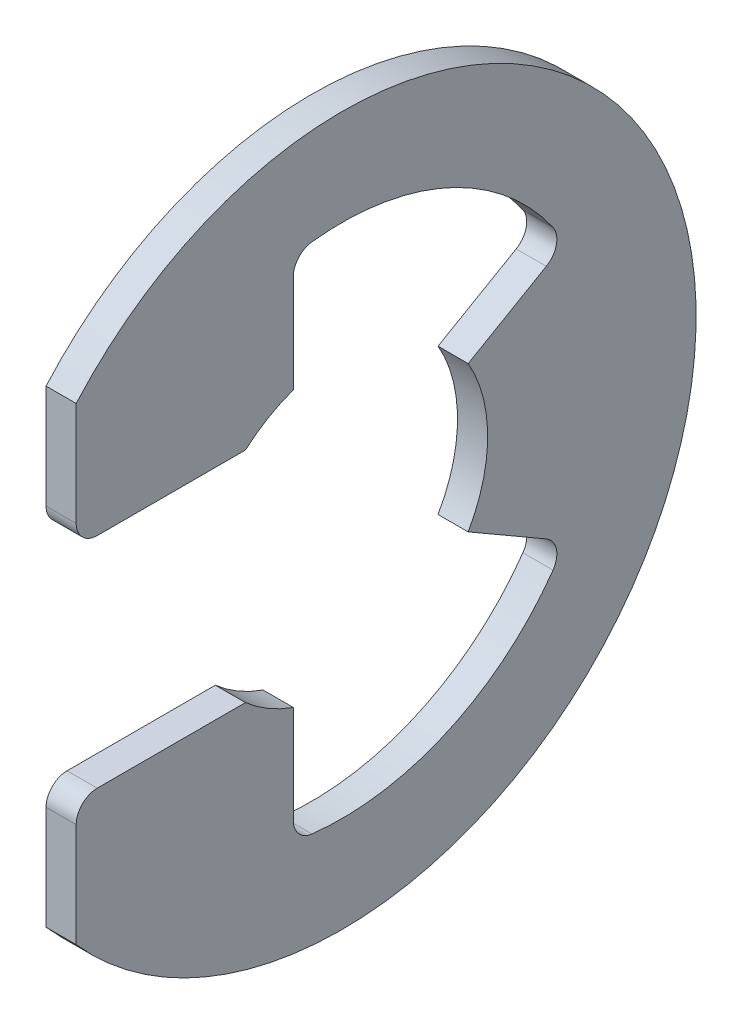
ISO-10303-21;
HEADER;
FILE_DESCRIPTION(('STEP AP214'),'2;1');
FILE_NAME('part.step','',(''),(''),'','','');
FILE_SCHEMA(('AUTOMOTIVE_DESIGN { 1 0 10303 214 1 1 1 1 }'));
ENDSEC;
DATA;
#1=APPLICATION_CONTEXT('core data for automotive mechanical design processes');
#2=APPLICATION_PROTOCOL_DEFINITION('international standard','automotive_design',2000,#1);
#3=PRODUCT_CONTEXT('',#1,'mechanical');
#4=PRODUCT('Part','Part','',(#3));
#5=PRODUCT_RELATED_PRODUCT_CATEGORY('part','',(#4));
#6=PRODUCT_DEFINITION_FORMATION('','',#4);
#7=PRODUCT_DEFINITION_CONTEXT('part definition',#1,'design');
#8=PRODUCT_DEFINITION('design','',#6,#7);
#9=PRODUCT_DEFINITION_SHAPE('','',#8);
#10=(LENGTH_UNIT() NAMED_UNIT(*) SI_UNIT(.MILLI.,.METRE.));
#11=(NAMED_UNIT(*) PLANE_ANGLE_UNIT() SI_UNIT($,.RADIAN.));
#12=(NAMED_UNIT(*) SI_UNIT($,.STERADIAN.) SOLID_ANGLE_UNIT());
#13=UNCERTAINTY_MEASURE_WITH_UNIT(LENGTH_MEASURE(1.E-05),#10,'distance_accuracy_value','');
#14=(GEOMETRIC_REPRESENTATION_CONTEXT(3) GLOBAL_UNCERTAINTY_ASSIGNED_CONTEXT((#13)) GLOBAL_UNIT_ASSIGNED_CONTEXT((#10,
#11,#12)) REPRESENTATION_CONTEXT('',''));
#15=CARTESIAN_POINT('',(0.,0.,0.));
#16=DIRECTION('',(0.,0.,1.));
#17=DIRECTION('',(1.,0.,0.));
#18=AXIS2_PLACEMENT_3D('',#15,#16,#17);
#19=CARTESIAN_POINT('',(0.3175,0.,0.));
#20=DIRECTION('',(-1.,0.,0.));
#21=DIRECTION('',(0.,0.,1.));
#22=AXIS2_PLACEMENT_3D('',#19,#20,#21);
#23=CYLINDRICAL_SURFACE('',#22,7.4676);
#24=CARTESIAN_POINT('',(-0.3175,0.,0.));
#25=DIRECTION('',(1.,0.,0.));
#26=DIRECTION('',(0.,0.,-1.));
#27=AXIS2_PLACEMENT_3D('',#24,#25,#26);
#28=CIRCLE('',#27,7.4676);
#29=CARTESIAN_POINT('',(-0.3175,-4.93935312262648,5.6007));
#30=VERTEX_POINT('',#29);
#31=CARTESIAN_POINT('',(-0.3175,4.93935312262648,5.6007));
#32=VERTEX_POINT('',#31);
#33=EDGE_CURVE('E194',#30,#32,#28,.T.);
#34=ORIENTED_EDGE('',*,*,#33,.T.);
#35=DIRECTION('',(-1.,0.,0.));
#36=VECTOR('',#35,1.);
#37=CARTESIAN_POINT('',(0.3175,4.93935312262648,5.6007));
#38=LINE('',#37,#36);
#39=CARTESIAN_POINT('',(0.3175,4.93935312262648,5.6007));
#40=VERTEX_POINT('',#39);
#41=EDGE_CURVE('E175',#40,#32,#38,.T.);
#42=ORIENTED_EDGE('',*,*,#41,.F.);
#43=CARTESIAN_POINT('',(0.3175,0.,0.));
#44=DIRECTION('',(1.,0.,0.));
#45=DIRECTION('',(0.,0.,-1.));
#46=AXIS2_PLACEMENT_3D('',#43,#44,#45);
#47=CIRCLE('',#46,7.4676);
#48=CARTESIAN_POINT('',(0.3175,-4.93935312262648,5.6007));
#49=VERTEX_POINT('',#48);
#50=EDGE_CURVE('E181',#49,#40,#47,.T.);
#51=ORIENTED_EDGE('',*,*,#50,.F.);
#52=DIRECTION('',(-1.,0.,0.));
#53=VECTOR('',#52,1.);
#54=CARTESIAN_POINT('',(0.3175,-4.93935312262648,5.6007));
#55=LINE('',#54,#53);
#56=EDGE_CURVE('E296',#49,#30,#55,.T.);
#57=ORIENTED_EDGE('',*,*,#56,.T.);
#58=EDGE_LOOP('',(#34,#42,#51,#57));
#59=FACE_BOUND('',#58,.T.);
#60=ADVANCED_FACE('F32',(#59),#23,.T.);
#61=CARTESIAN_POINT('',(0.3175,4.93935312262648,5.6007));
#62=DIRECTION('',(0.,0.,-1.));
#63=DIRECTION('',(-1.,0.,0.));
#64=AXIS2_PLACEMENT_3D('',#61,#62,#63);
#65=PLANE('',#64);
#66=DIRECTION('',(0.,-1.,0.));
#67=VECTOR('',#66,1.);
#68=CARTESIAN_POINT('',(-0.3175,4.93935312262648,5.6007));
#69=LINE('',#68,#67);
#70=CARTESIAN_POINT('',(-0.3175,2.74955,5.6007));
#71=VERTEX_POINT('',#70);
#72=EDGE_CURVE('E298',#32,#71,#69,.T.);
#73=ORIENTED_EDGE('',*,*,#72,.T.);
#74=DIRECTION('',(-1.,0.,0.));
#75=VECTOR('',#74,1.);
#76=CARTESIAN_POINT('',(0.3175,2.74955,5.6007));
#77=LINE('',#76,#75);
#78=CARTESIAN_POINT('',(0.3175,2.74955,5.6007));
#79=VERTEX_POINT('',#78);
#80=EDGE_CURVE('E178',#71,#79,#77,.F.);
#81=ORIENTED_EDGE('',*,*,#80,.T.);
#82=DIRECTION('',(0.,-1.,0.));
#83=VECTOR('',#82,1.);
#84=CARTESIAN_POINT('',(0.3175,4.93935312262648,5.6007));
#85=LINE('',#84,#83);
#86=EDGE_CURVE('E170',#40,#79,#85,.T.);
#87=ORIENTED_EDGE('',*,*,#86,.F.);
#88=ORIENTED_EDGE('',*,*,#41,.T.);
#89=EDGE_LOOP('',(#73,#81,#87,#88));
#90=FACE_BOUND('',#89,.T.);
#91=ADVANCED_FACE('F173',(#90),#65,.F.);
#92=CARTESIAN_POINT('',(0.3175,2.30505,2.03286301985648));
#93=DIRECTION('',(0.,1.,0.));
#94=DIRECTION('',(0.,0.,1.));
#95=AXIS2_PLACEMENT_3D('',#92,#93,#94);
#96=PLANE('',#95);
#97=DIRECTION('',(0.,0.,-1.));
#98=VECTOR('',#97,1.);
#99=CARTESIAN_POINT('',(0.3175,2.30505,2.03286301985648));
#100=LINE('',#99,#98);
#101=CARTESIAN_POINT('',(0.3175,2.30505,5.1562));
#102=VERTEX_POINT('',#101);
#103=CARTESIAN_POINT('',(0.3175,2.30505,2.03286301985648));
#104=VERTEX_POINT('',#103);
#105=EDGE_CURVE('E180',#102,#104,#100,.T.);
#106=ORIENTED_EDGE('',*,*,#105,.F.);
#107=DIRECTION('',(-1.,0.,0.));
#108=VECTOR('',#107,1.);
#109=CARTESIAN_POINT('',(0.3175,2.30505,5.1562));
#110=LINE('',#109,#108);
#111=CARTESIAN_POINT('',(-0.3175,2.30505,5.1562));
#112=VERTEX_POINT('',#111);
#113=EDGE_CURVE('E222',#102,#112,#110,.T.);
#114=ORIENTED_EDGE('',*,*,#113,.T.);
#115=DIRECTION('',(0.,0.,-1.));
#116=VECTOR('',#115,1.);
#117=CARTESIAN_POINT('',(-0.3175,2.30505,2.03286301985648));
#118=LINE('',#117,#116);
#119=CARTESIAN_POINT('',(-0.3175,2.30505,2.03286301985648));
#120=VERTEX_POINT('',#119);
#121=EDGE_CURVE('E300',#112,#120,#118,.T.);
#122=ORIENTED_EDGE('',*,*,#121,.T.);
#123=DIRECTION('',(-1.,0.,0.));
#124=VECTOR('',#123,1.);
#125=CARTESIAN_POINT('',(0.3175,2.30505,2.03286301985648));
#126=LINE('',#125,#124);
#127=EDGE_CURVE('E196',#104,#120,#126,.T.);
#128=ORIENTED_EDGE('',*,*,#127,.F.);
#129=EDGE_LOOP('',(#106,#114,#122,#128));
#130=FACE_BOUND('',#129,.T.);
#131=ADVANCED_FACE('F354',(#130),#96,.F.);
#132=CARTESIAN_POINT('',(0.3175,0.,0.));
#133=DIRECTION('',(-1.,0.,0.));
#134=DIRECTION('',(0.,0.,1.));
#135=AXIS2_PLACEMENT_3D('',#132,#133,#134);
#136=CYLINDRICAL_SURFACE('',#135,3.0734);
#137=CARTESIAN_POINT('',(-0.3175,0.,0.));
#138=DIRECTION('',(-1.,0.,0.));
#139=DIRECTION('',(0.,0.,1.));
#140=AXIS2_PLACEMENT_3D('',#137,#138,#139);
#141=CIRCLE('',#140,3.0734);
#142=CARTESIAN_POINT('',(-0.3175,2.89762930839831,1.02446666666667));
#143=VERTEX_POINT('',#142);
#144=EDGE_CURVE('E302',#120,#143,#141,.T.);
#145=ORIENTED_EDGE('',*,*,#144,.T.);
#146=DIRECTION('',(-1.,0.,0.));
#147=VECTOR('',#146,1.);
#148=CARTESIAN_POINT('',(0.3175,2.89762930839831,1.02446666666667));
#149=LINE('',#148,#147);
#150=CARTESIAN_POINT('',(0.3175,2.89762930839831,1.02446666666667));
#151=VERTEX_POINT('',#150);
#152=EDGE_CURVE('E202',#151,#143,#149,.T.);
#153=ORIENTED_EDGE('',*,*,#152,.F.);
#154=CARTESIAN_POINT('',(0.3175,0.,0.));
#155=DIRECTION('',(-1.,0.,0.));
#156=DIRECTION('',(0.,0.,1.));
#157=AXIS2_PLACEMENT_3D('',#154,#155,#156);
#158=CIRCLE('',#157,3.0734);
#159=EDGE_CURVE('E347',#104,#151,#158,.T.);
#160=ORIENTED_EDGE('',*,*,#159,.F.);
#161=ORIENTED_EDGE('',*,*,#127,.T.);
#162=EDGE_LOOP('',(#145,#153,#160,#161));
#163=FACE_BOUND('',#162,.T.);
#164=ADVANCED_FACE('F355',(#163),#136,.F.);
#165=CARTESIAN_POINT('',(0.3175,5.3431904138959,1.02446666666667));
#166=DIRECTION('',(0.,0.,1.));
#167=DIRECTION('',(0.,-1.,0.));
#168=AXIS2_PLACEMENT_3D('',#165,#166,#167);
#169=PLANE('',#168);
#170=DIRECTION('',(0.,1.,0.));
#171=VECTOR('',#170,1.);
#172=CARTESIAN_POINT('',(-0.3175,5.3431904138959,1.02446666666667));
#173=LINE('',#172,#171);
#174=CARTESIAN_POINT('',(-0.3175,4.96223899334827,1.02446666666667));
#175=VERTEX_POINT('',#174);
#176=EDGE_CURVE('E265',#143,#175,#173,.T.);
#177=ORIENTED_EDGE('',*,*,#176,.T.);
#178=DIRECTION('',(1.,0.,0.));
#179=VECTOR('',#178,1.);
#180=CARTESIAN_POINT('',(0.3175,4.96223899334827,1.02446666666667));
#181=LINE('',#180,#179);
#182=CARTESIAN_POINT('',(0.3175,4.96223899334827,1.02446666666667));
#183=VERTEX_POINT('',#182);
#184=EDGE_CURVE('E231',#175,#183,#181,.T.);
#185=ORIENTED_EDGE('',*,*,#184,.T.);
#186=DIRECTION('',(0.,1.,0.));
#187=VECTOR('',#186,1.);
#188=CARTESIAN_POINT('',(0.3175,5.3431904138959,1.02446666666667));
#189=LINE('',#188,#187);
#190=EDGE_CURVE('E281',#151,#183,#189,.T.);
#191=ORIENTED_EDGE('',*,*,#190,.F.);
#192=ORIENTED_EDGE('',*,*,#152,.T.);
#193=EDGE_LOOP('',(#177,#185,#191,#192));
#194=FACE_BOUND('',#193,.T.);
#195=ADVANCED_FACE('F337',(#194),#169,.F.);
#196=CARTESIAN_POINT('',(0.3175,0.,0.));
#197=DIRECTION('',(-1.,0.,0.));
#198=DIRECTION('',(0.,0.,1.));
#199=AXIS2_PLACEMENT_3D('',#196,#197,#198);
#200=CYLINDRICAL_SURFACE('',#199,5.44051612903226);
#201=CARTESIAN_POINT('',(0.3175,0.,0.));
#202=DIRECTION('',(-1.,0.,0.));
#203=DIRECTION('',(0.,0.,-1.));
#204=AXIS2_PLACEMENT_3D('',#201,#202,#203);
#205=CIRCLE('',#204,5.44051612903226);
#206=CARTESIAN_POINT('',(0.3175,5.40373381153464,0.631566817001502));
#207=VERTEX_POINT('',#206);
#208=CARTESIAN_POINT('',(0.3175,3.12866762176277,-4.45091615993757));
#209=VERTEX_POINT('',#208);
#210=EDGE_CURVE('E271',#207,#209,#205,.T.);
#211=ORIENTED_EDGE('',*,*,#210,.F.);
#212=DIRECTION('',(-1.,0.,0.));
#213=VECTOR('',#212,1.);
#214=CARTESIAN_POINT('',(0.3175,5.40373381153464,0.631566817001502));
#215=LINE('',#214,#213);
#216=CARTESIAN_POINT('',(-0.3175,5.40373381153464,0.631566817001502));
#217=VERTEX_POINT('',#216);
#218=EDGE_CURVE('E228',#207,#217,#215,.T.);
#219=ORIENTED_EDGE('',*,*,#218,.T.);
#220=CARTESIAN_POINT('',(-0.3175,0.,0.));
#221=DIRECTION('',(-1.,0.,0.));
#222=DIRECTION('',(0.,0.,-1.));
#223=AXIS2_PLACEMENT_3D('',#220,#221,#222);
#224=CIRCLE('',#223,5.44051612903226);
#225=CARTESIAN_POINT('',(-0.3175,3.12866762176277,-4.45091615993757));
#226=VERTEX_POINT('',#225);
#227=EDGE_CURVE('E254',#217,#226,#224,.T.);
#228=ORIENTED_EDGE('',*,*,#227,.T.);
#229=DIRECTION('',(-1.,0.,0.));
#230=VECTOR('',#229,1.);
#231=CARTESIAN_POINT('',(0.3175,3.12866762176277,-4.45091615993757));
#232=LINE('',#231,#230);
#233=EDGE_CURVE('E226',#226,#209,#232,.F.);
#234=ORIENTED_EDGE('',*,*,#233,.T.);
#235=EDGE_LOOP('',(#211,#219,#228,#234));
#236=FACE_BOUND('',#235,.T.);
#237=ADVANCED_FACE('F262',(#236),#200,.F.);
#238=CARTESIAN_POINT('',(0.3175,1.5367,-2.66164247599109));
#239=DIRECTION('',(0.,-0.866025403784438,-0.500000000000001));
#240=DIRECTION('',(0.,0.500000000000001,-0.866025403784438));
#241=AXIS2_PLACEMENT_3D('',#238,#239,#240);
#242=PLANE('',#241);
#243=DIRECTION('',(0.,-0.500000000000001,0.866025403784438));
#244=VECTOR('',#243,1.);
#245=CARTESIAN_POINT('',(0.3175,1.5367,-2.66164247599109));
#246=LINE('',#245,#244);
#247=CARTESIAN_POINT('',(0.3175,2.48810153086397,-4.30951826584629));
#248=VERTEX_POINT('',#247);
#249=CARTESIAN_POINT('',(0.3175,1.5367,-2.66164247599109));
#250=VERTEX_POINT('',#249);
#251=EDGE_CURVE('E269',#248,#250,#246,.T.);
#252=ORIENTED_EDGE('',*,*,#251,.F.);
#253=DIRECTION('',(1.,0.,0.));
#254=VECTOR('',#253,1.);
#255=CARTESIAN_POINT('',(-0.3175,2.48810153086397,-4.30951826584629));
#256=LINE('',#255,#254);
#257=CARTESIAN_POINT('',(-0.3175,2.48810153086397,-4.30951826584629));
#258=VERTEX_POINT('',#257);
#259=EDGE_CURVE('E235',#248,#258,#256,.F.);
#260=ORIENTED_EDGE('',*,*,#259,.T.);
#261=DIRECTION('',(0.,-0.500000000000001,0.866025403784438));
#262=VECTOR('',#261,1.);
#263=CARTESIAN_POINT('',(-0.3175,1.5367,-2.66164247599109));
#264=LINE('',#263,#262);
#265=CARTESIAN_POINT('',(-0.3175,1.5367,-2.66164247599109));
#266=VERTEX_POINT('',#265);
#267=EDGE_CURVE('E256',#258,#266,#264,.T.);
#268=ORIENTED_EDGE('',*,*,#267,.T.);
#269=DIRECTION('',(-1.,0.,0.));
#270=VECTOR('',#269,1.);
#271=CARTESIAN_POINT('',(0.3175,1.5367,-2.66164247599109));
#272=LINE('',#271,#270);
#273=EDGE_CURVE('E275',#250,#266,#272,.T.);
#274=ORIENTED_EDGE('',*,*,#273,.F.);
#275=EDGE_LOOP('',(#252,#260,#268,#274));
#276=FACE_BOUND('',#275,.T.);
#277=ADVANCED_FACE('F273',(#276),#242,.F.);
#278=CARTESIAN_POINT('',(0.3175,0.,0.));
#279=DIRECTION('',(-1.,0.,0.));
#280=DIRECTION('',(0.,0.,1.));
#281=AXIS2_PLACEMENT_3D('',#278,#279,#280);
#282=CYLINDRICAL_SURFACE('',#281,3.0734);
#283=CARTESIAN_POINT('',(-0.3175,0.,0.));
#284=DIRECTION('',(-1.,0.,0.));
#285=DIRECTION('',(0.,0.,1.));
#286=AXIS2_PLACEMENT_3D('',#283,#284,#285);
#287=CIRCLE('',#286,3.0734);
#288=CARTESIAN_POINT('',(-0.3175,-1.5367,-2.66164247599109));
#289=VERTEX_POINT('',#288);
#290=EDGE_CURVE('E307',#266,#289,#287,.T.);
#291=ORIENTED_EDGE('',*,*,#290,.T.);
#292=DIRECTION('',(-1.,0.,0.));
#293=VECTOR('',#292,1.);
#294=CARTESIAN_POINT('',(0.3175,-1.5367,-2.66164247599109));
#295=LINE('',#294,#293);
#296=CARTESIAN_POINT('',(0.3175,-1.5367,-2.66164247599109));
#297=VERTEX_POINT('',#296);
#298=EDGE_CURVE('E329',#297,#289,#295,.T.);
#299=ORIENTED_EDGE('',*,*,#298,.F.);
#300=CARTESIAN_POINT('',(0.3175,0.,0.));
#301=DIRECTION('',(-1.,0.,0.));
#302=DIRECTION('',(0.,0.,1.));
#303=AXIS2_PLACEMENT_3D('',#300,#301,#302);
#304=CIRCLE('',#303,3.0734);
#305=EDGE_CURVE('E277',#250,#297,#304,.T.);
#306=ORIENTED_EDGE('',*,*,#305,.F.);
#307=ORIENTED_EDGE('',*,*,#273,.T.);
#308=EDGE_LOOP('',(#291,#299,#306,#307));
#309=FACE_BOUND('',#308,.T.);
#310=ADVANCED_FACE('F435',(#309),#282,.F.);
#311=CARTESIAN_POINT('',(0.3175,-1.5367,-2.66164247599109));
#312=DIRECTION('',(0.,0.866025403784438,-0.500000000000001));
#313=DIRECTION('',(0.,0.500000000000001,0.866025403784438));
#314=AXIS2_PLACEMENT_3D('',#311,#312,#313);
#315=PLANE('',#314);
#316=DIRECTION('',(0.,-0.500000000000001,-0.866025403784438));
#317=VECTOR('',#316,1.);
#318=CARTESIAN_POINT('',(-0.3175,-1.5367,-2.66164247599109));
#319=LINE('',#318,#317);
#320=CARTESIAN_POINT('',(-0.3175,-2.48810153086397,-4.30951826584629));
#321=VERTEX_POINT('',#320);
#322=EDGE_CURVE('E309',#289,#321,#319,.T.);
#323=ORIENTED_EDGE('',*,*,#322,.T.);
#324=DIRECTION('',(1.,0.,0.));
#325=VECTOR('',#324,1.);
#326=CARTESIAN_POINT('',(0.3175,-2.48810153086397,-4.30951826584629));
#327=LINE('',#326,#325);
#328=CARTESIAN_POINT('',(0.3175,-2.48810153086397,-4.30951826584629));
#329=VERTEX_POINT('',#328);
#330=EDGE_CURVE('E233',#321,#329,#327,.T.);
#331=ORIENTED_EDGE('',*,*,#330,.T.);
#332=DIRECTION('',(0.,-0.500000000000001,-0.866025403784438));
#333=VECTOR('',#332,1.);
#334=CARTESIAN_POINT('',(0.3175,-1.5367,-2.66164247599109));
#335=LINE('',#334,#333);
#336=EDGE_CURVE('E279',#297,#329,#335,.T.);
#337=ORIENTED_EDGE('',*,*,#336,.F.);
#338=ORIENTED_EDGE('',*,*,#298,.T.);
#339=EDGE_LOOP('',(#323,#331,#337,#338));
#340=FACE_BOUND('',#339,.T.);
#341=ADVANCED_FACE('F432',(#340),#315,.F.);
#342=CARTESIAN_POINT('',(0.3175,0.,0.));
#343=DIRECTION('',(-1.,0.,0.));
#344=DIRECTION('',(0.,0.,1.));
#345=AXIS2_PLACEMENT_3D('',#342,#343,#344);
#346=CYLINDRICAL_SURFACE('',#345,5.44051612903226);
#347=CARTESIAN_POINT('',(-0.3175,0.,0.));
#348=DIRECTION('',(-1.,0.,0.));
#349=DIRECTION('',(0.,0.,-1.));
#350=AXIS2_PLACEMENT_3D('',#347,#348,#349);
#351=CIRCLE('',#350,5.44051612903226);
#352=CARTESIAN_POINT('',(-0.3175,-3.12866762176276,-4.45091615993758));
#353=VERTEX_POINT('',#352);
#354=CARTESIAN_POINT('',(-0.3175,-5.40373381153464,0.631566817001501));
#355=VERTEX_POINT('',#354);
#356=EDGE_CURVE('E312',#353,#355,#351,.T.);
#357=ORIENTED_EDGE('',*,*,#356,.T.);
#358=DIRECTION('',(-1.,0.,0.));
#359=VECTOR('',#358,1.);
#360=CARTESIAN_POINT('',(0.3175,-5.40373381153464,0.631566817001501));
#361=LINE('',#360,#359);
#362=CARTESIAN_POINT('',(0.3175,-5.40373381153464,0.631566817001501));
#363=VERTEX_POINT('',#362);
#364=EDGE_CURVE('E55',#355,#363,#361,.F.);
#365=ORIENTED_EDGE('',*,*,#364,.T.);
#366=CARTESIAN_POINT('',(0.3175,0.,0.));
#367=DIRECTION('',(-1.,0.,0.));
#368=DIRECTION('',(0.,0.,-1.));
#369=AXIS2_PLACEMENT_3D('',#366,#367,#368);
#370=CIRCLE('',#369,5.44051612903226);
#371=CARTESIAN_POINT('',(0.3175,-3.12866762176276,-4.45091615993758));
#372=VERTEX_POINT('',#371);
#373=EDGE_CURVE('E287',#372,#363,#370,.T.);
#374=ORIENTED_EDGE('',*,*,#373,.F.);
#375=DIRECTION('',(-1.,0.,0.));
#376=VECTOR('',#375,1.);
#377=CARTESIAN_POINT('',(0.3175,-3.12866762176276,-4.45091615993758));
#378=LINE('',#377,#376);
#379=EDGE_CURVE('E218',#372,#353,#378,.T.);
#380=ORIENTED_EDGE('',*,*,#379,.T.);
#381=EDGE_LOOP('',(#357,#365,#374,#380));
#382=FACE_BOUND('',#381,.T.);
#383=ADVANCED_FACE('F394',(#382),#346,.F.);
#384=CARTESIAN_POINT('',(0.3175,-2.89762930839831,1.02446666666666));
#385=DIRECTION('',(0.,0.,1.));
#386=DIRECTION('',(0.,-1.,0.));
#387=AXIS2_PLACEMENT_3D('',#384,#385,#386);
#388=PLANE('',#387);
#389=DIRECTION('',(0.,1.,0.));
#390=VECTOR('',#389,1.);
#391=CARTESIAN_POINT('',(0.3175,-2.89762930839831,1.02446666666666));
#392=LINE('',#391,#390);
#393=CARTESIAN_POINT('',(0.3175,-4.96223899334827,1.02446666666666));
#394=VERTEX_POINT('',#393);
#395=CARTESIAN_POINT('',(0.3175,-2.89762930839831,1.02446666666667));
#396=VERTEX_POINT('',#395);
#397=EDGE_CURVE('E289',#394,#396,#392,.T.);
#398=ORIENTED_EDGE('',*,*,#397,.F.);
#399=DIRECTION('',(1.,0.,0.));
#400=VECTOR('',#399,1.);
#401=CARTESIAN_POINT('',(-0.3175,-4.96223899334827,1.02446666666666));
#402=LINE('',#401,#400);
#403=CARTESIAN_POINT('',(-0.3175,-4.96223899334827,1.02446666666666));
#404=VERTEX_POINT('',#403);
#405=EDGE_CURVE('E215',#394,#404,#402,.F.);
#406=ORIENTED_EDGE('',*,*,#405,.T.);
#407=DIRECTION('',(0.,1.,0.));
#408=VECTOR('',#407,1.);
#409=CARTESIAN_POINT('',(-0.3175,-2.89762930839831,1.02446666666666));
#410=LINE('',#409,#408);
#411=CARTESIAN_POINT('',(-0.3175,-2.89762930839831,1.02446666666667));
#412=VERTEX_POINT('',#411);
#413=EDGE_CURVE('E314',#404,#412,#410,.T.);
#414=ORIENTED_EDGE('',*,*,#413,.T.);
#415=DIRECTION('',(-1.,0.,0.));
#416=VECTOR('',#415,1.);
#417=CARTESIAN_POINT('',(0.3175,-2.89762930839831,1.02446666666667));
#418=LINE('',#417,#416);
#419=EDGE_CURVE('E326',#396,#412,#418,.T.);
#420=ORIENTED_EDGE('',*,*,#419,.F.);
#421=EDGE_LOOP('',(#398,#406,#414,#420));
#422=FACE_BOUND('',#421,.T.);
#423=ADVANCED_FACE('F401',(#422),#388,.F.);
#424=CARTESIAN_POINT('',(0.3175,0.,0.));
#425=DIRECTION('',(-1.,0.,0.));
#426=DIRECTION('',(0.,0.,1.));
#427=AXIS2_PLACEMENT_3D('',#424,#425,#426);
#428=CYLINDRICAL_SURFACE('',#427,3.0734);
#429=CARTESIAN_POINT('',(-0.3175,0.,0.));
#430=DIRECTION('',(-1.,0.,0.));
#431=DIRECTION('',(0.,0.,-1.));
#432=AXIS2_PLACEMENT_3D('',#429,#430,#431);
#433=CIRCLE('',#432,3.0734);
#434=CARTESIAN_POINT('',(-0.3175,-2.30505,2.03286301985648));
#435=VERTEX_POINT('',#434);
#436=EDGE_CURVE('E316',#412,#435,#433,.T.);
#437=ORIENTED_EDGE('',*,*,#436,.T.);
#438=DIRECTION('',(-1.,0.,0.));
#439=VECTOR('',#438,1.);
#440=CARTESIAN_POINT('',(0.3175,-2.30505,2.03286301985648));
#441=LINE('',#440,#439);
#442=CARTESIAN_POINT('',(0.3175,-2.30505,2.03286301985648));
#443=VERTEX_POINT('',#442);
#444=EDGE_CURVE('E323',#443,#435,#441,.T.);
#445=ORIENTED_EDGE('',*,*,#444,.F.);
#446=CARTESIAN_POINT('',(0.3175,0.,0.));
#447=DIRECTION('',(-1.,0.,0.));
#448=DIRECTION('',(0.,0.,-1.));
#449=AXIS2_PLACEMENT_3D('',#446,#447,#448);
#450=CIRCLE('',#449,3.0734);
#451=EDGE_CURVE('E291',#396,#443,#450,.T.);
#452=ORIENTED_EDGE('',*,*,#451,.F.);
#453=ORIENTED_EDGE('',*,*,#419,.T.);
#454=EDGE_LOOP('',(#437,#445,#452,#453));
#455=FACE_BOUND('',#454,.T.);
#456=ADVANCED_FACE('F408',(#455),#428,.F.);
#457=CARTESIAN_POINT('',(0.3175,-2.30505,5.6007));
#458=DIRECTION('',(0.,-1.,0.));
#459=DIRECTION('',(0.,0.,-1.));
#460=AXIS2_PLACEMENT_3D('',#457,#458,#459);
#461=PLANE('',#460);
#462=DIRECTION('',(0.,0.,1.));
#463=VECTOR('',#462,1.);
#464=CARTESIAN_POINT('',(-0.3175,-2.30505,5.6007));
#465=LINE('',#464,#463);
#466=CARTESIAN_POINT('',(-0.3175,-2.30505,5.1562));
#467=VERTEX_POINT('',#466);
#468=EDGE_CURVE('E318',#435,#467,#465,.T.);
#469=ORIENTED_EDGE('',*,*,#468,.T.);
#470=DIRECTION('',(-1.,0.,0.));
#471=VECTOR('',#470,1.);
#472=CARTESIAN_POINT('',(0.3175,-2.30505,5.1562));
#473=LINE('',#472,#471);
#474=CARTESIAN_POINT('',(0.3175,-2.30505,5.1562));
#475=VERTEX_POINT('',#474);
#476=EDGE_CURVE('E209',#467,#475,#473,.F.);
#477=ORIENTED_EDGE('',*,*,#476,.T.);
#478=DIRECTION('',(0.,0.,1.));
#479=VECTOR('',#478,1.);
#480=CARTESIAN_POINT('',(0.3175,-2.30505,5.6007));
#481=LINE('',#480,#479);
#482=EDGE_CURVE('E293',#443,#475,#481,.T.);
#483=ORIENTED_EDGE('',*,*,#482,.F.);
#484=ORIENTED_EDGE('',*,*,#444,.T.);
#485=EDGE_LOOP('',(#469,#477,#483,#484));
#486=FACE_BOUND('',#485,.T.);
#487=ADVANCED_FACE('F411',(#486),#461,.F.);
#488=CARTESIAN_POINT('',(0.3175,-4.93935312262648,5.6007));
#489=DIRECTION('',(0.,0.,-1.));
#490=DIRECTION('',(-1.,0.,0.));
#491=AXIS2_PLACEMENT_3D('',#488,#489,#490);
#492=PLANE('',#491);
#493=DIRECTION('',(0.,-1.,0.));
#494=VECTOR('',#493,1.);
#495=CARTESIAN_POINT('',(0.3175,-4.93935312262648,5.6007));
#496=LINE('',#495,#494);
#497=CARTESIAN_POINT('',(0.3175,-2.74955,5.6007));
#498=VERTEX_POINT('',#497);
#499=EDGE_CURVE('E187',#498,#49,#496,.T.);
#500=ORIENTED_EDGE('',*,*,#499,.F.);
#501=DIRECTION('',(-1.,0.,0.));
#502=VECTOR('',#501,1.);
#503=CARTESIAN_POINT('',(0.3175,-2.74955,5.6007));
#504=LINE('',#503,#502);
#505=CARTESIAN_POINT('',(-0.3175,-2.74955,5.6007));
#506=VERTEX_POINT('',#505);
#507=EDGE_CURVE('E195',#498,#506,#504,.T.);
#508=ORIENTED_EDGE('',*,*,#507,.T.);
#509=DIRECTION('',(0.,-1.,0.));
#510=VECTOR('',#509,1.);
#511=CARTESIAN_POINT('',(-0.3175,-4.93935312262648,5.6007));
#512=LINE('',#511,#510);
#513=EDGE_CURVE('E191',#506,#30,#512,.T.);
#514=ORIENTED_EDGE('',*,*,#513,.T.);
#515=ORIENTED_EDGE('',*,*,#56,.F.);
#516=EDGE_LOOP('',(#500,#508,#514,#515));
#517=FACE_BOUND('',#516,.T.);
#518=ADVANCED_FACE('F415',(#517),#492,.F.);
#519=CARTESIAN_POINT('',(0.3175,0.,0.));
#520=DIRECTION('',(1.,0.,0.));
#521=DIRECTION('',(0.,0.,-1.));
#522=AXIS2_PLACEMENT_3D('',#519,#520,#521);
#523=PLANE('',#522);
#524=ORIENTED_EDGE('',*,*,#482,.T.);
#525=CARTESIAN_POINT('',(0.3175,-2.74955,5.1562));
#526=DIRECTION('',(1.,0.,0.));
#527=DIRECTION('',(0.,0.,-1.));
#528=AXIS2_PLACEMENT_3D('',#525,#526,#527);
#529=CIRCLE('',#528,0.4445);
#530=EDGE_CURVE('E213',#475,#498,#529,.T.);
#531=ORIENTED_EDGE('',*,*,#530,.T.);
#532=ORIENTED_EDGE('',*,*,#499,.T.);
#533=ORIENTED_EDGE('',*,*,#50,.T.);
#534=ORIENTED_EDGE('',*,*,#86,.T.);
#535=CARTESIAN_POINT('',(0.3175,2.74955,5.1562));
#536=DIRECTION('',(1.,0.,0.));
#537=DIRECTION('',(0.,0.,-1.));
#538=AXIS2_PLACEMENT_3D('',#535,#536,#537);
#539=CIRCLE('',#538,0.4445);
#540=EDGE_CURVE('E211',#79,#102,#539,.T.);
#541=ORIENTED_EDGE('',*,*,#540,.T.);
#542=ORIENTED_EDGE('',*,*,#105,.T.);
#543=ORIENTED_EDGE('',*,*,#159,.T.);
#544=ORIENTED_EDGE('',*,*,#190,.T.);
#545=CARTESIAN_POINT('',(0.3175,4.96223899334827,0.579966666666666));
#546=DIRECTION('',(1.,0.,0.));
#547=DIRECTION('',(0.,0.,-1.));
#548=AXIS2_PLACEMENT_3D('',#545,#546,#547);
#549=CIRCLE('',#548,0.4445);
#550=EDGE_CURVE('E243',#183,#207,#549,.F.);
#551=ORIENTED_EDGE('',*,*,#550,.T.);
#552=ORIENTED_EDGE('',*,*,#210,.T.);
#553=CARTESIAN_POINT('',(0.3175,2.87304982284616,-4.08726826584629));
#554=DIRECTION('',(1.,0.,0.));
#555=DIRECTION('',(0.,0.,-1.));
#556=AXIS2_PLACEMENT_3D('',#553,#554,#555);
#557=CIRCLE('',#556,0.4445);
#558=EDGE_CURVE('E11',#209,#248,#557,.F.);
#559=ORIENTED_EDGE('',*,*,#558,.T.);
#560=ORIENTED_EDGE('',*,*,#251,.T.);
#561=ORIENTED_EDGE('',*,*,#305,.T.);
#562=ORIENTED_EDGE('',*,*,#336,.T.);
#563=CARTESIAN_POINT('',(0.3175,-2.87304982284615,-4.08726826584629));
#564=DIRECTION('',(1.,0.,0.));
#565=DIRECTION('',(0.,0.,-1.));
#566=AXIS2_PLACEMENT_3D('',#563,#564,#565);
#567=CIRCLE('',#566,0.4445);
#568=EDGE_CURVE('E247',#329,#372,#567,.F.);
#569=ORIENTED_EDGE('',*,*,#568,.T.);
#570=ORIENTED_EDGE('',*,*,#373,.T.);
#571=CARTESIAN_POINT('',(0.3175,-4.96223899334827,0.579966666666665));
#572=DIRECTION('',(1.,0.,0.));
#573=DIRECTION('',(0.,0.,-1.));
#574=AXIS2_PLACEMENT_3D('',#571,#572,#573);
#575=CIRCLE('',#574,0.4445);
#576=EDGE_CURVE('E47',#363,#394,#575,.F.);
#577=ORIENTED_EDGE('',*,*,#576,.T.);
#578=ORIENTED_EDGE('',*,*,#397,.T.);
#579=ORIENTED_EDGE('',*,*,#451,.T.);
#580=EDGE_LOOP('',(#524,#531,#532,#533,#534,#541,#542,#543,#544,#551,#552,#559,#560,#561,#562,
#569,#570,#577,#578,#579));
#581=FACE_BOUND('',#580,.T.);
#582=ADVANCED_FACE('F185',(#581),#523,.T.);
#583=CARTESIAN_POINT('',(-0.3175,0.,0.));
#584=DIRECTION('',(1.,0.,0.));
#585=DIRECTION('',(0.,0.,-1.));
#586=AXIS2_PLACEMENT_3D('',#583,#584,#585);
#587=PLANE('',#586);
#588=ORIENTED_EDGE('',*,*,#513,.F.);
#589=CARTESIAN_POINT('',(-0.3175,-2.74955,5.1562));
#590=DIRECTION('',(1.,0.,0.));
#591=DIRECTION('',(0.,0.,-1.));
#592=AXIS2_PLACEMENT_3D('',#589,#590,#591);
#593=CIRCLE('',#592,0.4445);
#594=EDGE_CURVE('E207',#506,#467,#593,.F.);
#595=ORIENTED_EDGE('',*,*,#594,.T.);
#596=ORIENTED_EDGE('',*,*,#468,.F.);
#597=ORIENTED_EDGE('',*,*,#436,.F.);
#598=ORIENTED_EDGE('',*,*,#413,.F.);
#599=CARTESIAN_POINT('',(-0.3175,-4.96223899334827,0.579966666666665));
#600=DIRECTION('',(1.,0.,0.));
#601=DIRECTION('',(0.,0.,-1.));
#602=AXIS2_PLACEMENT_3D('',#599,#600,#601);
#603=CIRCLE('',#602,0.4445);
#604=EDGE_CURVE('E238',#404,#355,#603,.T.);
#605=ORIENTED_EDGE('',*,*,#604,.T.);
#606=ORIENTED_EDGE('',*,*,#356,.F.);
#607=CARTESIAN_POINT('',(-0.3175,-2.87304982284615,-4.08726826584629));
#608=DIRECTION('',(1.,0.,0.));
#609=DIRECTION('',(0.,0.,-1.));
#610=AXIS2_PLACEMENT_3D('',#607,#608,#609);
#611=CIRCLE('',#610,0.4445);
#612=EDGE_CURVE('E245',#353,#321,#611,.T.);
#613=ORIENTED_EDGE('',*,*,#612,.T.);
#614=ORIENTED_EDGE('',*,*,#322,.F.);
#615=ORIENTED_EDGE('',*,*,#290,.F.);
#616=ORIENTED_EDGE('',*,*,#267,.F.);
#617=CARTESIAN_POINT('',(-0.3175,2.87304982284616,-4.08726826584629));
#618=DIRECTION('',(1.,0.,0.));
#619=DIRECTION('',(0.,0.,-1.));
#620=AXIS2_PLACEMENT_3D('',#617,#618,#619);
#621=CIRCLE('',#620,0.4445);
#622=EDGE_CURVE('E40',#258,#226,#621,.T.);
#623=ORIENTED_EDGE('',*,*,#622,.T.);
#624=ORIENTED_EDGE('',*,*,#227,.F.);
#625=CARTESIAN_POINT('',(-0.3175,4.96223899334827,0.579966666666666));
#626=DIRECTION('',(1.,0.,0.));
#627=DIRECTION('',(0.,0.,-1.));
#628=AXIS2_PLACEMENT_3D('',#625,#626,#627);
#629=CIRCLE('',#628,0.4445);
#630=EDGE_CURVE('E241',#217,#175,#629,.T.);
#631=ORIENTED_EDGE('',*,*,#630,.T.);
#632=ORIENTED_EDGE('',*,*,#176,.F.);
#633=ORIENTED_EDGE('',*,*,#144,.F.);
#634=ORIENTED_EDGE('',*,*,#121,.F.);
#635=CARTESIAN_POINT('',(-0.3175,2.74955,5.1562));
#636=DIRECTION('',(1.,0.,0.));
#637=DIRECTION('',(0.,0.,-1.));
#638=AXIS2_PLACEMENT_3D('',#635,#636,#637);
#639=CIRCLE('',#638,0.4445);
#640=EDGE_CURVE('E199',#112,#71,#639,.F.);
#641=ORIENTED_EDGE('',*,*,#640,.T.);
#642=ORIENTED_EDGE('',*,*,#72,.F.);
#643=ORIENTED_EDGE('',*,*,#33,.F.);
#644=EDGE_LOOP('',(#588,#595,#596,#597,#598,#605,#606,#613,#614,#615,#616,#623,#624,#631,#632,
#633,#634,#641,#642,#643));
#645=FACE_BOUND('',#644,.T.);
#646=ADVANCED_FACE('F253',(#645),#587,.F.);
#647=CARTESIAN_POINT('',(0.3175,-2.74955,5.1562));
#648=DIRECTION('',(-1.,0.,0.));
#649=DIRECTION('',(0.,0.,1.));
#650=AXIS2_PLACEMENT_3D('',#647,#648,#649);
#651=CYLINDRICAL_SURFACE('',#650,0.4445);
#652=ORIENTED_EDGE('',*,*,#530,.F.);
#653=ORIENTED_EDGE('',*,*,#476,.F.);
#654=ORIENTED_EDGE('',*,*,#594,.F.);
#655=ORIENTED_EDGE('',*,*,#507,.F.);
#656=EDGE_LOOP('',(#652,#653,#654,#655));
#657=FACE_BOUND('',#656,.T.);
#658=ADVANCED_FACE('F371',(#657),#651,.T.);
#659=CARTESIAN_POINT('',(0.3175,-4.96223899334827,0.579966666666665));
#660=DIRECTION('',(-1.,0.,0.));
#661=DIRECTION('',(0.,0.,1.));
#662=AXIS2_PLACEMENT_3D('',#659,#660,#661);
#663=CYLINDRICAL_SURFACE('',#662,0.4445);
#664=ORIENTED_EDGE('',*,*,#576,.F.);
#665=ORIENTED_EDGE('',*,*,#364,.F.);
#666=ORIENTED_EDGE('',*,*,#604,.F.);
#667=ORIENTED_EDGE('',*,*,#405,.F.);
#668=EDGE_LOOP('',(#664,#665,#666,#667));
#669=FACE_BOUND('',#668,.T.);
#670=ADVANCED_FACE('F374',(#669),#663,.F.);
#671=CARTESIAN_POINT('',(0.3175,2.74955,5.1562));
#672=DIRECTION('',(-1.,0.,0.));
#673=DIRECTION('',(0.,0.,1.));
#674=AXIS2_PLACEMENT_3D('',#671,#672,#673);
#675=CYLINDRICAL_SURFACE('',#674,0.4445);
#676=ORIENTED_EDGE('',*,*,#540,.F.);
#677=ORIENTED_EDGE('',*,*,#80,.F.);
#678=ORIENTED_EDGE('',*,*,#640,.F.);
#679=ORIENTED_EDGE('',*,*,#113,.F.);
#680=EDGE_LOOP('',(#676,#677,#678,#679));
#681=FACE_BOUND('',#680,.T.);
#682=ADVANCED_FACE('F378',(#681),#675,.T.);
#683=CARTESIAN_POINT('',(0.3175,4.96223899334827,0.579966666666666));
#684=DIRECTION('',(-1.,0.,0.));
#685=DIRECTION('',(0.,0.,1.));
#686=AXIS2_PLACEMENT_3D('',#683,#684,#685);
#687=CYLINDRICAL_SURFACE('',#686,0.4445);
#688=ORIENTED_EDGE('',*,*,#550,.F.);
#689=ORIENTED_EDGE('',*,*,#184,.F.);
#690=ORIENTED_EDGE('',*,*,#630,.F.);
#691=ORIENTED_EDGE('',*,*,#218,.F.);
#692=EDGE_LOOP('',(#688,#689,#690,#691));
#693=FACE_BOUND('',#692,.T.);
#694=ADVANCED_FACE('F346',(#693),#687,.F.);
#695=CARTESIAN_POINT('',(0.3175,-2.87304982284615,-4.08726826584629));
#696=DIRECTION('',(-1.,0.,0.));
#697=DIRECTION('',(0.,0.,1.));
#698=AXIS2_PLACEMENT_3D('',#695,#696,#697);
#699=CYLINDRICAL_SURFACE('',#698,0.4445);
#700=ORIENTED_EDGE('',*,*,#568,.F.);
#701=ORIENTED_EDGE('',*,*,#330,.F.);
#702=ORIENTED_EDGE('',*,*,#612,.F.);
#703=ORIENTED_EDGE('',*,*,#379,.F.);
#704=EDGE_LOOP('',(#700,#701,#702,#703));
#705=FACE_BOUND('',#704,.T.);
#706=ADVANCED_FACE('F384',(#705),#699,.F.);
#707=CARTESIAN_POINT('',(0.3175,2.87304982284616,-4.08726826584629));
#708=DIRECTION('',(-1.,0.,0.));
#709=DIRECTION('',(0.,0.,1.));
#710=AXIS2_PLACEMENT_3D('',#707,#708,#709);
#711=CYLINDRICAL_SURFACE('',#710,0.4445);
#712=ORIENTED_EDGE('',*,*,#558,.F.);
#713=ORIENTED_EDGE('',*,*,#233,.F.);
#714=ORIENTED_EDGE('',*,*,#622,.F.);
#715=ORIENTED_EDGE('',*,*,#259,.F.);
#716=EDGE_LOOP('',(#712,#713,#714,#715));
#717=FACE_BOUND('',#716,.T.);
#718=ADVANCED_FACE('F34',(#717),#711,.F.);
#719=CLOSED_SHELL('',(#60,#91,#131,#164,#195,#237,#277,#310,#341,#383,#423,#456,#487,#518,#582,
#646,#658,#670,#682,#694,#706,#718));
#720=MANIFOLD_SOLID_BREP('B2',#719);
#721=ADVANCED_BREP_SHAPE_REPRESENTATION('',(#18,#720),#14);
#722=SHAPE_DEFINITION_REPRESENTATION(#9,#721);
ENDSEC;
END-ISO-10303-21;
